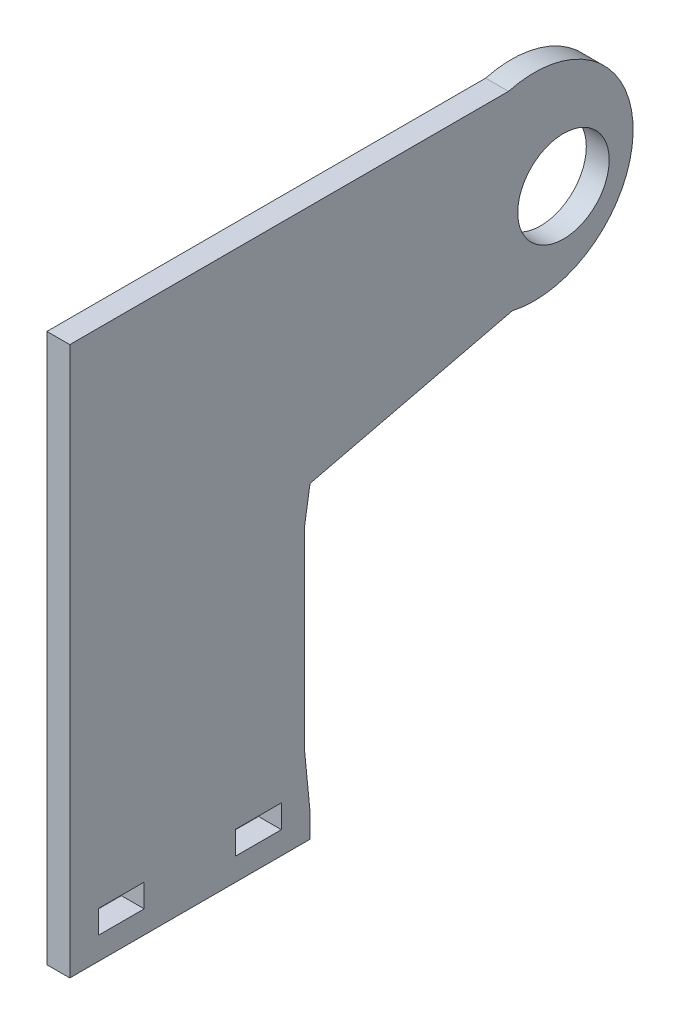
ISO-10303-21;
HEADER;
FILE_DESCRIPTION(('STEP AP214'),'2;1');
FILE_NAME('part.step','',(''),(''),'','','');
FILE_SCHEMA(('AUTOMOTIVE_DESIGN { 1 0 10303 214 1 1 1 1 }'));
ENDSEC;
DATA;
#1=APPLICATION_CONTEXT('core data for automotive mechanical design processes');
#2=APPLICATION_PROTOCOL_DEFINITION('international standard','automotive_design',2000,#1);
#3=PRODUCT_CONTEXT('',#1,'mechanical');
#4=PRODUCT('Part','Part','',(#3));
#5=PRODUCT_RELATED_PRODUCT_CATEGORY('part','',(#4));
#6=PRODUCT_DEFINITION_FORMATION('','',#4);
#7=PRODUCT_DEFINITION_CONTEXT('part definition',#1,'design');
#8=PRODUCT_DEFINITION('design','',#6,#7);
#9=PRODUCT_DEFINITION_SHAPE('','',#8);
#10=(LENGTH_UNIT() NAMED_UNIT(*) SI_UNIT(.MILLI.,.METRE.));
#11=(NAMED_UNIT(*) PLANE_ANGLE_UNIT() SI_UNIT($,.RADIAN.));
#12=(NAMED_UNIT(*) SI_UNIT($,.STERADIAN.) SOLID_ANGLE_UNIT());
#13=UNCERTAINTY_MEASURE_WITH_UNIT(LENGTH_MEASURE(1.E-05),#10,'distance_accuracy_value','');
#14=(GEOMETRIC_REPRESENTATION_CONTEXT(3) GLOBAL_UNCERTAINTY_ASSIGNED_CONTEXT((#13)) GLOBAL_UNIT_ASSIGNED_CONTEXT((#10,
#11,#12)) REPRESENTATION_CONTEXT('',''));
#15=CARTESIAN_POINT('',(0.,0.,0.));
#16=DIRECTION('',(0.,0.,1.));
#17=DIRECTION('',(1.,0.,0.));
#18=AXIS2_PLACEMENT_3D('',#15,#16,#17);
#19=CARTESIAN_POINT('',(3.175,-35.5826713443496,17.7913356721748));
#20=DIRECTION('',(0.,0.,-1.));
#21=DIRECTION('',(-1.,0.,0.));
#22=AXIS2_PLACEMENT_3D('',#19,#20,#21);
#23=PLANE('',#22);
#24=DIRECTION('',(0.,-1.,0.));
#25=VECTOR('',#24,1.);
#26=CARTESIAN_POINT('',(0.,-35.5826713443496,17.7913356721748));
#27=LINE('',#26,#25);
#28=CARTESIAN_POINT('',(0.,40.6173286556504,17.7913356721748));
#29=VERTEX_POINT('',#28);
#30=CARTESIAN_POINT('',(0.,-35.5826713443496,17.7913356721748));
#31=VERTEX_POINT('',#30);
#32=EDGE_CURVE('E246',#29,#31,#27,.T.);
#33=ORIENTED_EDGE('',*,*,#32,.T.);
#34=DIRECTION('',(-1.,0.,0.));
#35=VECTOR('',#34,1.);
#36=CARTESIAN_POINT('',(3.175,-35.5826713443496,17.7913356721748));
#37=LINE('',#36,#35);
#38=CARTESIAN_POINT('',(3.175,-35.5826713443496,17.7913356721748));
#39=VERTEX_POINT('',#38);
#40=EDGE_CURVE('E40',#39,#31,#37,.T.);
#41=ORIENTED_EDGE('',*,*,#40,.F.);
#42=DIRECTION('',(0.,-1.,0.));
#43=VECTOR('',#42,1.);
#44=CARTESIAN_POINT('',(3.175,-35.5826713443496,17.7913356721748));
#45=LINE('',#44,#43);
#46=CARTESIAN_POINT('',(3.175,40.6173286556504,17.7913356721748));
#47=VERTEX_POINT('',#46);
#48=EDGE_CURVE('E252',#47,#39,#45,.T.);
#49=ORIENTED_EDGE('',*,*,#48,.F.);
#50=DIRECTION('',(-1.,0.,0.));
#51=VECTOR('',#50,1.);
#52=CARTESIAN_POINT('',(3.175,40.6173286556504,17.7913356721748));
#53=LINE('',#52,#51);
#54=EDGE_CURVE('E11',#47,#29,#53,.T.);
#55=ORIENTED_EDGE('',*,*,#54,.T.);
#56=EDGE_LOOP('',(#33,#41,#49,#55));
#57=FACE_BOUND('',#56,.T.);
#58=ADVANCED_FACE('F33',(#57),#23,.F.);
#59=CARTESIAN_POINT('',(3.175,-35.5826713443496,17.7913356721748));
#60=DIRECTION('',(0.,1.,0.));
#61=DIRECTION('',(0.,0.,1.));
#62=AXIS2_PLACEMENT_3D('',#59,#60,#61);
#63=PLANE('',#62);
#64=DIRECTION('',(0.,0.,-1.));
#65=VECTOR('',#64,1.);
#66=CARTESIAN_POINT('',(0.,-35.5826713443496,17.7913356721748));
#67=LINE('',#66,#65);
#68=CARTESIAN_POINT('',(0.,-35.5826713443496,-15.5860385444608));
#69=VERTEX_POINT('',#68);
#70=EDGE_CURVE('E267',#31,#69,#67,.T.);
#71=ORIENTED_EDGE('',*,*,#70,.T.);
#72=DIRECTION('',(-1.,0.,0.));
#73=VECTOR('',#72,1.);
#74=CARTESIAN_POINT('',(3.175,-35.5826713443496,-15.5860385444608));
#75=LINE('',#74,#73);
#76=CARTESIAN_POINT('',(3.175,-35.5826713443496,-15.5860385444608));
#77=VERTEX_POINT('',#76);
#78=EDGE_CURVE('E285',#77,#69,#75,.T.);
#79=ORIENTED_EDGE('',*,*,#78,.F.);
#80=DIRECTION('',(0.,0.,-1.));
#81=VECTOR('',#80,1.);
#82=CARTESIAN_POINT('',(3.175,-35.5826713443496,17.7913356721748));
#83=LINE('',#82,#81);
#84=EDGE_CURVE('E255',#39,#77,#83,.T.);
#85=ORIENTED_EDGE('',*,*,#84,.F.);
#86=ORIENTED_EDGE('',*,*,#40,.T.);
#87=EDGE_LOOP('',(#71,#79,#85,#86));
#88=FACE_BOUND('',#87,.T.);
#89=ADVANCED_FACE('F292',(#88),#63,.F.);
#90=CARTESIAN_POINT('',(3.175,-35.5826713443496,-15.5860385444608));
#91=DIRECTION('',(0.,0.,1.));
#92=DIRECTION('',(1.,0.,0.));
#93=AXIS2_PLACEMENT_3D('',#90,#91,#92);
#94=PLANE('',#93);
#95=DIRECTION('',(0.,1.,0.));
#96=VECTOR('',#95,1.);
#97=CARTESIAN_POINT('',(0.,-35.5826713443496,-15.5860385444608));
#98=LINE('',#97,#96);
#99=CARTESIAN_POINT('',(0.,-32.2734489461194,-15.586038544461));
#100=VERTEX_POINT('',#99);
#101=EDGE_CURVE('E269',#69,#100,#98,.T.);
#102=ORIENTED_EDGE('',*,*,#101,.T.);
#103=DIRECTION('',(-1.,0.,0.));
#104=VECTOR('',#103,1.);
#105=CARTESIAN_POINT('',(3.175,-32.2734489461167,-15.5860385444608));
#106=LINE('',#105,#104);
#107=CARTESIAN_POINT('',(3.175,-32.2734489461167,-15.5860385444608));
#108=VERTEX_POINT('',#107);
#109=EDGE_CURVE('E230',#108,#100,#106,.T.);
#110=ORIENTED_EDGE('',*,*,#109,.F.);
#111=DIRECTION('',(0.,1.,0.));
#112=VECTOR('',#111,1.);
#113=CARTESIAN_POINT('',(3.175,-35.5826713443496,-15.5860385444608));
#114=LINE('',#113,#112);
#115=EDGE_CURVE('E257',#77,#108,#114,.T.);
#116=ORIENTED_EDGE('',*,*,#115,.F.);
#117=ORIENTED_EDGE('',*,*,#78,.T.);
#118=EDGE_LOOP('',(#102,#110,#116,#117));
#119=FACE_BOUND('',#118,.T.);
#120=ADVANCED_FACE('F305',(#119),#94,.F.);
#121=CARTESIAN_POINT('',(3.175,13.9487256606145,-43.6921949323939));
#122=DIRECTION('',(0.,0.972584786292787,0.232548561534606));
#123=DIRECTION('',(0.,-0.232548561534606,0.972584786292787));
#124=AXIS2_PLACEMENT_3D('',#121,#122,#123);
#125=PLANE('',#124);
#126=DIRECTION('',(0.,0.232548561534606,-0.972584786292787));
#127=VECTOR('',#126,1.);
#128=CARTESIAN_POINT('',(0.,13.9487256606145,-43.6921949323939));
#129=LINE('',#128,#127);
#130=CARTESIAN_POINT('',(0.,7.22844139296306,-15.5860385444608));
#131=VERTEX_POINT('',#130);
#132=CARTESIAN_POINT('',(0.,13.9487256606145,-43.6921949323939));
#133=VERTEX_POINT('',#132);
#134=EDGE_CURVE('E272',#131,#133,#129,.T.);
#135=ORIENTED_EDGE('',*,*,#134,.T.);
#136=DIRECTION('',(-1.,0.,0.));
#137=VECTOR('',#136,1.);
#138=CARTESIAN_POINT('',(3.175,13.9487256606145,-43.6921949323939));
#139=LINE('',#138,#137);
#140=CARTESIAN_POINT('',(3.175,13.9487256606145,-43.6921949323939));
#141=VERTEX_POINT('',#140);
#142=EDGE_CURVE('E279',#141,#133,#139,.T.);
#143=ORIENTED_EDGE('',*,*,#142,.F.);
#144=DIRECTION('',(0.,0.232548561534606,-0.972584786292787));
#145=VECTOR('',#144,1.);
#146=CARTESIAN_POINT('',(3.175,13.9487256606145,-43.6921949323939));
#147=LINE('',#146,#145);
#148=CARTESIAN_POINT('',(3.175,7.22844139296306,-15.5860385444608));
#149=VERTEX_POINT('',#148);
#150=EDGE_CURVE('E260',#149,#141,#147,.T.);
#151=ORIENTED_EDGE('',*,*,#150,.F.);
#152=DIRECTION('',(-1.,0.,0.));
#153=VECTOR('',#152,1.);
#154=CARTESIAN_POINT('',(3.175,7.22844139296306,-15.5860385444608));
#155=LINE('',#154,#153);
#156=EDGE_CURVE('E282',#149,#131,#155,.T.);
#157=ORIENTED_EDGE('',*,*,#156,.T.);
#158=EDGE_LOOP('',(#135,#143,#151,#157));
#159=FACE_BOUND('',#158,.T.);
#160=ADVANCED_FACE('F321',(#159),#125,.F.);
#161=CARTESIAN_POINT('',(3.175,27.3492292647664,-46.7286770017625));
#162=DIRECTION('',(-1.,0.,0.));
#163=DIRECTION('',(0.,0.,1.));
#164=AXIS2_PLACEMENT_3D('',#161,#162,#163);
#165=CYLINDRICAL_SURFACE('',#164,13.740222712987);
#166=CARTESIAN_POINT('',(0.,27.3492292647664,-46.7286770017625));
#167=DIRECTION('',(1.,0.,0.));
#168=DIRECTION('',(0.,0.,1.));
#169=AXIS2_PLACEMENT_3D('',#166,#167,#168);
#170=CIRCLE('',#169,13.740222712987);
#171=CARTESIAN_POINT('',(0.,40.6173286556504,-43.1577865307303));
#172=VERTEX_POINT('',#171);
#173=EDGE_CURVE('E274',#133,#172,#170,.T.);
#174=ORIENTED_EDGE('',*,*,#173,.T.);
#175=DIRECTION('',(-1.,0.,0.));
#176=VECTOR('',#175,1.);
#177=CARTESIAN_POINT('',(3.175,40.6173286556504,-43.1577865307303));
#178=LINE('',#177,#176);
#179=CARTESIAN_POINT('',(3.175,40.6173286556504,-43.1577865307303));
#180=VERTEX_POINT('',#179);
#181=EDGE_CURVE('E265',#180,#172,#178,.T.);
#182=ORIENTED_EDGE('',*,*,#181,.F.);
#183=CARTESIAN_POINT('',(3.175,27.3492292647664,-46.7286770017625));
#184=DIRECTION('',(1.,0.,0.));
#185=DIRECTION('',(0.,0.,1.));
#186=AXIS2_PLACEMENT_3D('',#183,#184,#185);
#187=CIRCLE('',#186,13.740222712987);
#188=EDGE_CURVE('E262',#141,#180,#187,.T.);
#189=ORIENTED_EDGE('',*,*,#188,.F.);
#190=ORIENTED_EDGE('',*,*,#142,.T.);
#191=EDGE_LOOP('',(#174,#182,#189,#190));
#192=FACE_BOUND('',#191,.T.);
#193=ADVANCED_FACE('F316',(#192),#165,.T.);
#194=CARTESIAN_POINT('',(3.175,40.6173286556504,-20.3086643278252));
#195=DIRECTION('',(0.,-1.,0.));
#196=DIRECTION('',(0.,0.,-1.));
#197=AXIS2_PLACEMENT_3D('',#194,#195,#196);
#198=PLANE('',#197);
#199=DIRECTION('',(0.,0.,1.));
#200=VECTOR('',#199,1.);
#201=CARTESIAN_POINT('',(0.,40.6173286556504,-20.3086643278252));
#202=LINE('',#201,#200);
#203=EDGE_CURVE('E253',#172,#29,#202,.T.);
#204=ORIENTED_EDGE('',*,*,#203,.T.);
#205=ORIENTED_EDGE('',*,*,#54,.F.);
#206=DIRECTION('',(0.,0.,1.));
#207=VECTOR('',#206,1.);
#208=CARTESIAN_POINT('',(3.175,40.6173286556504,17.7913356721748));
#209=LINE('',#208,#207);
#210=EDGE_CURVE('E249',#180,#47,#209,.T.);
#211=ORIENTED_EDGE('',*,*,#210,.F.);
#212=ORIENTED_EDGE('',*,*,#181,.T.);
#213=EDGE_LOOP('',(#204,#205,#211,#212));
#214=FACE_BOUND('',#213,.T.);
#215=ADVANCED_FACE('F311',(#214),#198,.F.);
#216=CARTESIAN_POINT('',(3.175,27.3492292647664,-46.7286770017625));
#217=DIRECTION('',(-1.,0.,0.));
#218=DIRECTION('',(0.,0.,1.));
#219=AXIS2_PLACEMENT_3D('',#216,#217,#218);
#220=PLANE('',#219);
#221=DIRECTION('',(0.,0.,1.));
#222=VECTOR('',#221,1.);
#223=CARTESIAN_POINT('',(3.175,-29.2072713443496,-5.24735143614301));
#224=LINE('',#223,#222);
#225=CARTESIAN_POINT('',(3.175,-29.2072713443496,-11.597351436143));
#226=VERTEX_POINT('',#225);
#227=CARTESIAN_POINT('',(3.175,-29.2072713443496,-5.24735143614301));
#228=VERTEX_POINT('',#227);
#229=EDGE_CURVE('E178',#226,#228,#224,.T.);
#230=ORIENTED_EDGE('',*,*,#229,.F.);
#231=DIRECTION('',(0.,1.,0.));
#232=VECTOR('',#231,1.);
#233=CARTESIAN_POINT('',(3.175,-32.4330713443496,-11.597351436143));
#234=LINE('',#233,#232);
#235=CARTESIAN_POINT('',(3.175,-32.4330713443496,-11.597351436143));
#236=VERTEX_POINT('',#235);
#237=EDGE_CURVE('E47',#236,#226,#234,.T.);
#238=ORIENTED_EDGE('',*,*,#237,.F.);
#239=DIRECTION('',(0.,0.,-1.));
#240=VECTOR('',#239,1.);
#241=CARTESIAN_POINT('',(3.175,-32.4330713443496,-5.24735143614301));
#242=LINE('',#241,#240);
#243=CARTESIAN_POINT('',(3.175,-32.4330713443496,-5.24735143614301));
#244=VERTEX_POINT('',#243);
#245=EDGE_CURVE('E169',#244,#236,#242,.T.);
#246=ORIENTED_EDGE('',*,*,#245,.F.);
#247=DIRECTION('',(0.,-1.,0.));
#248=VECTOR('',#247,1.);
#249=CARTESIAN_POINT('',(3.175,-32.4330713443496,-5.24735143614301));
#250=LINE('',#249,#248);
#251=EDGE_CURVE('E172',#228,#244,#250,.T.);
#252=ORIENTED_EDGE('',*,*,#251,.F.);
#253=EDGE_LOOP('',(#230,#238,#246,#252));
#254=FACE_BOUND('',#253,.T.);
#255=DIRECTION('',(0.,0.,1.));
#256=VECTOR('',#255,1.);
#257=CARTESIAN_POINT('',(3.175,-29.2072713443496,13.802648563857));
#258=LINE('',#257,#256);
#259=CARTESIAN_POINT('',(3.175,-29.2072713443496,7.45264856385699));
#260=VERTEX_POINT('',#259);
#261=CARTESIAN_POINT('',(3.175,-29.2072713443496,13.802648563857));
#262=VERTEX_POINT('',#261);
#263=EDGE_CURVE('E203',#260,#262,#258,.T.);
#264=ORIENTED_EDGE('',*,*,#263,.F.);
#265=DIRECTION('',(0.,1.,0.));
#266=VECTOR('',#265,1.);
#267=CARTESIAN_POINT('',(3.175,-32.4330713443496,7.45264856385699));
#268=LINE('',#267,#266);
#269=CARTESIAN_POINT('',(3.175,-32.4330713443496,7.45264856385699));
#270=VERTEX_POINT('',#269);
#271=EDGE_CURVE('E184',#270,#260,#268,.T.);
#272=ORIENTED_EDGE('',*,*,#271,.F.);
#273=DIRECTION('',(0.,0.,-1.));
#274=VECTOR('',#273,1.);
#275=CARTESIAN_POINT('',(3.175,-32.4330713443496,13.802648563857));
#276=LINE('',#275,#274);
#277=CARTESIAN_POINT('',(3.175,-32.4330713443496,13.802648563857));
#278=VERTEX_POINT('',#277);
#279=EDGE_CURVE('E192',#278,#270,#276,.T.);
#280=ORIENTED_EDGE('',*,*,#279,.F.);
#281=DIRECTION('',(0.,-1.,0.));
#282=VECTOR('',#281,1.);
#283=CARTESIAN_POINT('',(3.175,-32.4330713443496,13.802648563857));
#284=LINE('',#283,#282);
#285=EDGE_CURVE('E206',#262,#278,#284,.T.);
#286=ORIENTED_EDGE('',*,*,#285,.F.);
#287=EDGE_LOOP('',(#264,#272,#280,#286));
#288=FACE_BOUND('',#287,.T.);
#289=CARTESIAN_POINT('',(3.175,25.3773286556504,-50.7886643278252));
#290=DIRECTION('',(1.,0.,0.));
#291=DIRECTION('',(0.,0.,-1.));
#292=AXIS2_PLACEMENT_3D('',#289,#290,#291);
#293=CIRCLE('',#292,6.35);
#294=CARTESIAN_POINT('',(3.175,25.3773286556504,-57.1386643278252));
#295=VERTEX_POINT('',#294);
#296=EDGE_CURVE('E239',#295,#295,#293,.T.);
#297=ORIENTED_EDGE('',*,*,#296,.F.);
#298=EDGE_LOOP('',(#297));
#299=FACE_BOUND('',#298,.T.);
#300=DIRECTION('',(0.,1.,0.));
#301=VECTOR('',#300,1.);
#302=CARTESIAN_POINT('',(3.175,2.57854469380498,-14.8469713320735));
#303=LINE('',#302,#301);
#304=CARTESIAN_POINT('',(3.175,-24.7242806486608,-14.8469713320735));
#305=VERTEX_POINT('',#304);
#306=CARTESIAN_POINT('',(3.175,2.57854469380498,-14.8469713320735));
#307=VERTEX_POINT('',#306);
#308=EDGE_CURVE('E223',#305,#307,#303,.T.);
#309=ORIENTED_EDGE('',*,*,#308,.T.);
#310=DIRECTION('',(0.,0.987603005090068,-0.156972304363116));
#311=VECTOR('',#310,1.);
#312=CARTESIAN_POINT('',(3.175,7.22844139296306,-15.5860385444608));
#313=LINE('',#312,#311);
#314=EDGE_CURVE('E227',#307,#149,#313,.T.);
#315=ORIENTED_EDGE('',*,*,#314,.T.);
#316=ORIENTED_EDGE('',*,*,#150,.T.);
#317=ORIENTED_EDGE('',*,*,#188,.T.);
#318=ORIENTED_EDGE('',*,*,#210,.T.);
#319=ORIENTED_EDGE('',*,*,#48,.T.);
#320=ORIENTED_EDGE('',*,*,#84,.T.);
#321=ORIENTED_EDGE('',*,*,#115,.T.);
#322=DIRECTION('',(0.,0.995241923511694,0.0974346636713203));
#323=VECTOR('',#322,1.);
#324=CARTESIAN_POINT('',(3.175,-24.7242806486608,-14.8469713320735));
#325=LINE('',#324,#323);
#326=EDGE_CURVE('E220',#108,#305,#325,.T.);
#327=ORIENTED_EDGE('',*,*,#326,.T.);
#328=EDGE_LOOP('',(#309,#315,#316,#317,#318,#319,#320,#321,#327));
#329=FACE_BOUND('',#328,.T.);
#330=ADVANCED_FACE('F308',(#254,#288,#299,#329),#220,.F.);
#331=CARTESIAN_POINT('',(0.,27.3492292647664,-46.7286770017625));
#332=DIRECTION('',(-1.,0.,0.));
#333=DIRECTION('',(0.,0.,1.));
#334=AXIS2_PLACEMENT_3D('',#331,#332,#333);
#335=PLANE('',#334);
#336=DIRECTION('',(0.,1.,0.));
#337=VECTOR('',#336,1.);
#338=CARTESIAN_POINT('',(0.,-32.4330713443496,-11.597351436143));
#339=LINE('',#338,#337);
#340=CARTESIAN_POINT('',(0.,-32.4330713443496,-11.597351436143));
#341=VERTEX_POINT('',#340);
#342=CARTESIAN_POINT('',(0.,-29.2072713443496,-11.597351436143));
#343=VERTEX_POINT('',#342);
#344=EDGE_CURVE('E153',#341,#343,#339,.T.);
#345=ORIENTED_EDGE('',*,*,#344,.T.);
#346=DIRECTION('',(0.,0.,1.));
#347=VECTOR('',#346,1.);
#348=CARTESIAN_POINT('',(0.,-29.2072713443496,-5.24735143614301));
#349=LINE('',#348,#347);
#350=CARTESIAN_POINT('',(0.,-29.2072713443496,-5.24735143614302));
#351=VERTEX_POINT('',#350);
#352=EDGE_CURVE('E162',#343,#351,#349,.T.);
#353=ORIENTED_EDGE('',*,*,#352,.T.);
#354=DIRECTION('',(0.,-1.,0.));
#355=VECTOR('',#354,1.);
#356=CARTESIAN_POINT('',(0.,-32.4330713443496,-5.24735143614301));
#357=LINE('',#356,#355);
#358=CARTESIAN_POINT('',(0.,-32.4330713443496,-5.24735143614301));
#359=VERTEX_POINT('',#358);
#360=EDGE_CURVE('E55',#351,#359,#357,.T.);
#361=ORIENTED_EDGE('',*,*,#360,.T.);
#362=DIRECTION('',(0.,0.,-1.));
#363=VECTOR('',#362,1.);
#364=CARTESIAN_POINT('',(0.,-32.4330713443496,-5.24735143614301));
#365=LINE('',#364,#363);
#366=EDGE_CURVE('E159',#359,#341,#365,.T.);
#367=ORIENTED_EDGE('',*,*,#366,.T.);
#368=EDGE_LOOP('',(#345,#353,#361,#367));
#369=FACE_BOUND('',#368,.T.);
#370=DIRECTION('',(0.,1.,0.));
#371=VECTOR('',#370,1.);
#372=CARTESIAN_POINT('',(0.,-32.4330713443496,7.45264856385699));
#373=LINE('',#372,#371);
#374=CARTESIAN_POINT('',(0.,-32.4330713443496,7.45264856385699));
#375=VERTEX_POINT('',#374);
#376=CARTESIAN_POINT('',(0.,-29.2072713443496,7.45264856385699));
#377=VERTEX_POINT('',#376);
#378=EDGE_CURVE('E188',#375,#377,#373,.T.);
#379=ORIENTED_EDGE('',*,*,#378,.T.);
#380=DIRECTION('',(0.,0.,1.));
#381=VECTOR('',#380,1.);
#382=CARTESIAN_POINT('',(0.,-29.2072713443496,13.802648563857));
#383=LINE('',#382,#381);
#384=CARTESIAN_POINT('',(0.,-29.2072713443496,13.802648563857));
#385=VERTEX_POINT('',#384);
#386=EDGE_CURVE('E191',#377,#385,#383,.T.);
#387=ORIENTED_EDGE('',*,*,#386,.T.);
#388=DIRECTION('',(0.,-1.,0.));
#389=VECTOR('',#388,1.);
#390=CARTESIAN_POINT('',(0.,-32.4330713443496,13.802648563857));
#391=LINE('',#390,#389);
#392=CARTESIAN_POINT('',(0.,-32.4330713443496,13.802648563857));
#393=VERTEX_POINT('',#392);
#394=EDGE_CURVE('E195',#385,#393,#391,.T.);
#395=ORIENTED_EDGE('',*,*,#394,.T.);
#396=DIRECTION('',(0.,0.,-1.));
#397=VECTOR('',#396,1.);
#398=CARTESIAN_POINT('',(0.,-32.4330713443496,13.802648563857));
#399=LINE('',#398,#397);
#400=EDGE_CURVE('E198',#393,#375,#399,.T.);
#401=ORIENTED_EDGE('',*,*,#400,.T.);
#402=EDGE_LOOP('',(#379,#387,#395,#401));
#403=FACE_BOUND('',#402,.T.);
#404=DIRECTION('',(0.,0.987603005090068,-0.156972304363116));
#405=VECTOR('',#404,1.);
#406=CARTESIAN_POINT('',(0.,7.22844139296306,-15.5860385444608));
#407=LINE('',#406,#405);
#408=CARTESIAN_POINT('',(0.,2.57854469380498,-14.8469713320735));
#409=VERTEX_POINT('',#408);
#410=EDGE_CURVE('E224',#409,#131,#407,.T.);
#411=ORIENTED_EDGE('',*,*,#410,.F.);
#412=DIRECTION('',(0.,1.,0.));
#413=VECTOR('',#412,1.);
#414=CARTESIAN_POINT('',(0.,2.57854469380498,-14.8469713320735));
#415=LINE('',#414,#413);
#416=CARTESIAN_POINT('',(0.,-24.7242806486608,-14.8469713320735));
#417=VERTEX_POINT('',#416);
#418=EDGE_CURVE('E233',#417,#409,#415,.T.);
#419=ORIENTED_EDGE('',*,*,#418,.F.);
#420=DIRECTION('',(0.,0.995241923511694,0.0974346636713203));
#421=VECTOR('',#420,1.);
#422=CARTESIAN_POINT('',(0.,-24.7242806486608,-14.8469713320735));
#423=LINE('',#422,#421);
#424=EDGE_CURVE('E213',#100,#417,#423,.T.);
#425=ORIENTED_EDGE('',*,*,#424,.F.);
#426=ORIENTED_EDGE('',*,*,#101,.F.);
#427=ORIENTED_EDGE('',*,*,#70,.F.);
#428=ORIENTED_EDGE('',*,*,#32,.F.);
#429=ORIENTED_EDGE('',*,*,#203,.F.);
#430=ORIENTED_EDGE('',*,*,#173,.F.);
#431=ORIENTED_EDGE('',*,*,#134,.F.);
#432=EDGE_LOOP('',(#411,#419,#425,#426,#427,#428,#429,#430,#431));
#433=FACE_BOUND('',#432,.T.);
#434=CARTESIAN_POINT('',(0.,25.3773286556504,-50.7886643278252));
#435=DIRECTION('',(1.,0.,0.));
#436=DIRECTION('',(0.,0.,-1.));
#437=AXIS2_PLACEMENT_3D('',#434,#435,#436);
#438=CIRCLE('',#437,6.35);
#439=CARTESIAN_POINT('',(0.,25.3773286556504,-57.1386643278252));
#440=VERTEX_POINT('',#439);
#441=EDGE_CURVE('E243',#440,#440,#438,.T.);
#442=ORIENTED_EDGE('',*,*,#441,.T.);
#443=EDGE_LOOP('',(#442));
#444=FACE_BOUND('',#443,.T.);
#445=ADVANCED_FACE('F166',(#369,#403,#433,#444),#335,.T.);
#446=CARTESIAN_POINT('',(0.,25.3773286556504,-50.7886643278252));
#447=DIRECTION('',(1.,0.,0.));
#448=DIRECTION('',(0.,0.,-1.));
#449=AXIS2_PLACEMENT_3D('',#446,#447,#448);
#450=CYLINDRICAL_SURFACE('',#449,6.35);
#451=ORIENTED_EDGE('',*,*,#441,.F.);
#452=EDGE_LOOP('',(#451));
#453=FACE_BOUND('',#452,.T.);
#454=ORIENTED_EDGE('',*,*,#296,.T.);
#455=EDGE_LOOP('',(#454));
#456=FACE_BOUND('',#455,.T.);
#457=ADVANCED_FACE('F359',(#453,#456),#450,.F.);
#458=CARTESIAN_POINT('',(3.175,7.22844139296306,-15.5860385444608));
#459=DIRECTION('',(0.,0.156972304363116,0.987603005090068));
#460=DIRECTION('',(0.,-0.987603005090068,0.156972304363116));
#461=AXIS2_PLACEMENT_3D('',#458,#459,#460);
#462=PLANE('',#461);
#463=ORIENTED_EDGE('',*,*,#410,.T.);
#464=ORIENTED_EDGE('',*,*,#156,.F.);
#465=ORIENTED_EDGE('',*,*,#314,.F.);
#466=DIRECTION('',(-1.,0.,0.));
#467=VECTOR('',#466,1.);
#468=CARTESIAN_POINT('',(3.175,2.57854469380498,-14.8469713320735));
#469=LINE('',#468,#467);
#470=EDGE_CURVE('E237',#307,#409,#469,.T.);
#471=ORIENTED_EDGE('',*,*,#470,.T.);
#472=EDGE_LOOP('',(#463,#464,#465,#471));
#473=FACE_BOUND('',#472,.T.);
#474=ADVANCED_FACE('F324',(#473),#462,.F.);
#475=CARTESIAN_POINT('',(3.175,2.57854469380498,-14.8469713320735));
#476=DIRECTION('',(0.,0.,1.));
#477=DIRECTION('',(1.,0.,0.));
#478=AXIS2_PLACEMENT_3D('',#475,#476,#477);
#479=PLANE('',#478);
#480=ORIENTED_EDGE('',*,*,#418,.T.);
#481=ORIENTED_EDGE('',*,*,#470,.F.);
#482=ORIENTED_EDGE('',*,*,#308,.F.);
#483=DIRECTION('',(-1.,0.,0.));
#484=VECTOR('',#483,1.);
#485=CARTESIAN_POINT('',(3.175,-24.7242806486608,-14.8469713320735));
#486=LINE('',#485,#484);
#487=EDGE_CURVE('E240',#305,#417,#486,.T.);
#488=ORIENTED_EDGE('',*,*,#487,.T.);
#489=EDGE_LOOP('',(#480,#481,#482,#488));
#490=FACE_BOUND('',#489,.T.);
#491=ADVANCED_FACE('F327',(#490),#479,.F.);
#492=CARTESIAN_POINT('',(3.175,-24.7242806486608,-14.8469713320735));
#493=DIRECTION('',(0.,-0.0974346636713203,0.995241923511694));
#494=DIRECTION('',(0.,-0.995241923511694,-0.0974346636713203));
#495=AXIS2_PLACEMENT_3D('',#492,#493,#494);
#496=PLANE('',#495);
#497=ORIENTED_EDGE('',*,*,#424,.T.);
#498=ORIENTED_EDGE('',*,*,#487,.F.);
#499=ORIENTED_EDGE('',*,*,#326,.F.);
#500=ORIENTED_EDGE('',*,*,#109,.T.);
#501=EDGE_LOOP('',(#497,#498,#499,#500));
#502=FACE_BOUND('',#501,.T.);
#503=ADVANCED_FACE('F329',(#502),#496,.F.);
#504=CARTESIAN_POINT('',(0.,-32.4330713443496,7.45264856385699));
#505=DIRECTION('',(0.,0.,-1.));
#506=DIRECTION('',(-1.,0.,0.));
#507=AXIS2_PLACEMENT_3D('',#504,#505,#506);
#508=PLANE('',#507);
#509=ORIENTED_EDGE('',*,*,#271,.T.);
#510=DIRECTION('',(1.,0.,0.));
#511=VECTOR('',#510,1.);
#512=CARTESIAN_POINT('',(0.,-29.2072713443496,7.45264856385699));
#513=LINE('',#512,#511);
#514=EDGE_CURVE('E201',#377,#260,#513,.T.);
#515=ORIENTED_EDGE('',*,*,#514,.F.);
#516=ORIENTED_EDGE('',*,*,#378,.F.);
#517=DIRECTION('',(1.,0.,0.));
#518=VECTOR('',#517,1.);
#519=CARTESIAN_POINT('',(0.,-32.4330713443496,7.45264856385699));
#520=LINE('',#519,#518);
#521=EDGE_CURVE('E211',#375,#270,#520,.T.);
#522=ORIENTED_EDGE('',*,*,#521,.T.);
#523=EDGE_LOOP('',(#509,#515,#516,#522));
#524=FACE_BOUND('',#523,.T.);
#525=ADVANCED_FACE('F331',(#524),#508,.F.);
#526=CARTESIAN_POINT('',(0.,-32.4330713443496,13.802648563857));
#527=DIRECTION('',(0.,-1.,0.));
#528=DIRECTION('',(0.,0.,-1.));
#529=AXIS2_PLACEMENT_3D('',#526,#527,#528);
#530=PLANE('',#529);
#531=ORIENTED_EDGE('',*,*,#279,.T.);
#532=ORIENTED_EDGE('',*,*,#521,.F.);
#533=ORIENTED_EDGE('',*,*,#400,.F.);
#534=DIRECTION('',(1.,0.,0.));
#535=VECTOR('',#534,1.);
#536=CARTESIAN_POINT('',(0.,-32.4330713443496,13.802648563857));
#537=LINE('',#536,#535);
#538=EDGE_CURVE('E214',#393,#278,#537,.T.);
#539=ORIENTED_EDGE('',*,*,#538,.T.);
#540=EDGE_LOOP('',(#531,#532,#533,#539));
#541=FACE_BOUND('',#540,.T.);
#542=ADVANCED_FACE('F337',(#541),#530,.F.);
#543=CARTESIAN_POINT('',(0.,-32.4330713443496,13.802648563857));
#544=DIRECTION('',(0.,0.,1.));
#545=DIRECTION('',(0.,-1.,0.));
#546=AXIS2_PLACEMENT_3D('',#543,#544,#545);
#547=PLANE('',#546);
#548=ORIENTED_EDGE('',*,*,#285,.T.);
#549=ORIENTED_EDGE('',*,*,#538,.F.);
#550=ORIENTED_EDGE('',*,*,#394,.F.);
#551=DIRECTION('',(1.,0.,0.));
#552=VECTOR('',#551,1.);
#553=CARTESIAN_POINT('',(0.,-29.2072713443496,13.802648563857));
#554=LINE('',#553,#552);
#555=EDGE_CURVE('E216',#385,#262,#554,.T.);
#556=ORIENTED_EDGE('',*,*,#555,.T.);
#557=EDGE_LOOP('',(#548,#549,#550,#556));
#558=FACE_BOUND('',#557,.T.);
#559=ADVANCED_FACE('F378',(#558),#547,.F.);
#560=CARTESIAN_POINT('',(0.,-29.2072713443496,13.802648563857));
#561=DIRECTION('',(0.,1.,0.));
#562=DIRECTION('',(0.,0.,1.));
#563=AXIS2_PLACEMENT_3D('',#560,#561,#562);
#564=PLANE('',#563);
#565=ORIENTED_EDGE('',*,*,#263,.T.);
#566=ORIENTED_EDGE('',*,*,#555,.F.);
#567=ORIENTED_EDGE('',*,*,#386,.F.);
#568=ORIENTED_EDGE('',*,*,#514,.T.);
#569=EDGE_LOOP('',(#565,#566,#567,#568));
#570=FACE_BOUND('',#569,.T.);
#571=ADVANCED_FACE('F375',(#570),#564,.F.);
#572=CARTESIAN_POINT('',(0.,-32.4330713443496,-11.597351436143));
#573=DIRECTION('',(0.,0.,-1.));
#574=DIRECTION('',(-1.,0.,0.));
#575=AXIS2_PLACEMENT_3D('',#572,#573,#574);
#576=PLANE('',#575);
#577=ORIENTED_EDGE('',*,*,#237,.T.);
#578=DIRECTION('',(1.,0.,0.));
#579=VECTOR('',#578,1.);
#580=CARTESIAN_POINT('',(0.,-29.2072713443496,-11.597351436143));
#581=LINE('',#580,#579);
#582=EDGE_CURVE('E149',#343,#226,#581,.T.);
#583=ORIENTED_EDGE('',*,*,#582,.F.);
#584=ORIENTED_EDGE('',*,*,#344,.F.);
#585=DIRECTION('',(1.,0.,0.));
#586=VECTOR('',#585,1.);
#587=CARTESIAN_POINT('',(0.,-32.4330713443496,-11.597351436143));
#588=LINE('',#587,#586);
#589=EDGE_CURVE('E182',#341,#236,#588,.T.);
#590=ORIENTED_EDGE('',*,*,#589,.T.);
#591=EDGE_LOOP('',(#577,#583,#584,#590));
#592=FACE_BOUND('',#591,.T.);
#593=ADVANCED_FACE('F151',(#592),#576,.F.);
#594=CARTESIAN_POINT('',(0.,-32.4330713443496,-5.24735143614301));
#595=DIRECTION('',(0.,-1.,0.));
#596=DIRECTION('',(0.,0.,-1.));
#597=AXIS2_PLACEMENT_3D('',#594,#595,#596);
#598=PLANE('',#597);
#599=ORIENTED_EDGE('',*,*,#245,.T.);
#600=ORIENTED_EDGE('',*,*,#589,.F.);
#601=ORIENTED_EDGE('',*,*,#366,.F.);
#602=DIRECTION('',(1.,0.,0.));
#603=VECTOR('',#602,1.);
#604=CARTESIAN_POINT('',(0.,-32.4330713443496,-5.24735143614301));
#605=LINE('',#604,#603);
#606=EDGE_CURVE('E185',#359,#244,#605,.T.);
#607=ORIENTED_EDGE('',*,*,#606,.T.);
#608=EDGE_LOOP('',(#599,#600,#601,#607));
#609=FACE_BOUND('',#608,.T.);
#610=ADVANCED_FACE('F388',(#609),#598,.F.);
#611=CARTESIAN_POINT('',(0.,-32.4330713443496,-5.24735143614301));
#612=DIRECTION('',(0.,0.,1.));
#613=DIRECTION('',(1.,0.,0.));
#614=AXIS2_PLACEMENT_3D('',#611,#612,#613);
#615=PLANE('',#614);
#616=ORIENTED_EDGE('',*,*,#251,.T.);
#617=ORIENTED_EDGE('',*,*,#606,.F.);
#618=ORIENTED_EDGE('',*,*,#360,.F.);
#619=DIRECTION('',(1.,0.,0.));
#620=VECTOR('',#619,1.);
#621=CARTESIAN_POINT('',(0.,-29.2072713443496,-5.24735143614301));
#622=LINE('',#621,#620);
#623=EDGE_CURVE('E158',#351,#228,#622,.T.);
#624=ORIENTED_EDGE('',*,*,#623,.T.);
#625=EDGE_LOOP('',(#616,#617,#618,#624));
#626=FACE_BOUND('',#625,.T.);
#627=ADVANCED_FACE('F391',(#626),#615,.F.);
#628=CARTESIAN_POINT('',(0.,-29.2072713443496,-5.24735143614301));
#629=DIRECTION('',(0.,1.,0.));
#630=DIRECTION('',(0.,0.,1.));
#631=AXIS2_PLACEMENT_3D('',#628,#629,#630);
#632=PLANE('',#631);
#633=ORIENTED_EDGE('',*,*,#229,.T.);
#634=ORIENTED_EDGE('',*,*,#623,.F.);
#635=ORIENTED_EDGE('',*,*,#352,.F.);
#636=ORIENTED_EDGE('',*,*,#582,.T.);
#637=EDGE_LOOP('',(#633,#634,#635,#636));
#638=FACE_BOUND('',#637,.T.);
#639=ADVANCED_FACE('F163',(#638),#632,.F.);
#640=CLOSED_SHELL('',(#58,#89,#120,#160,#193,#215,#330,#445,#457,#474,#491,#503,#525,#542,#559,
#571,#593,#610,#627,#639));
#641=MANIFOLD_SOLID_BREP('B2',#640);
#642=ADVANCED_BREP_SHAPE_REPRESENTATION('',(#18,#641),#14);
#643=SHAPE_DEFINITION_REPRESENTATION(#9,#642);
ENDSEC;
END-ISO-10303-21;
